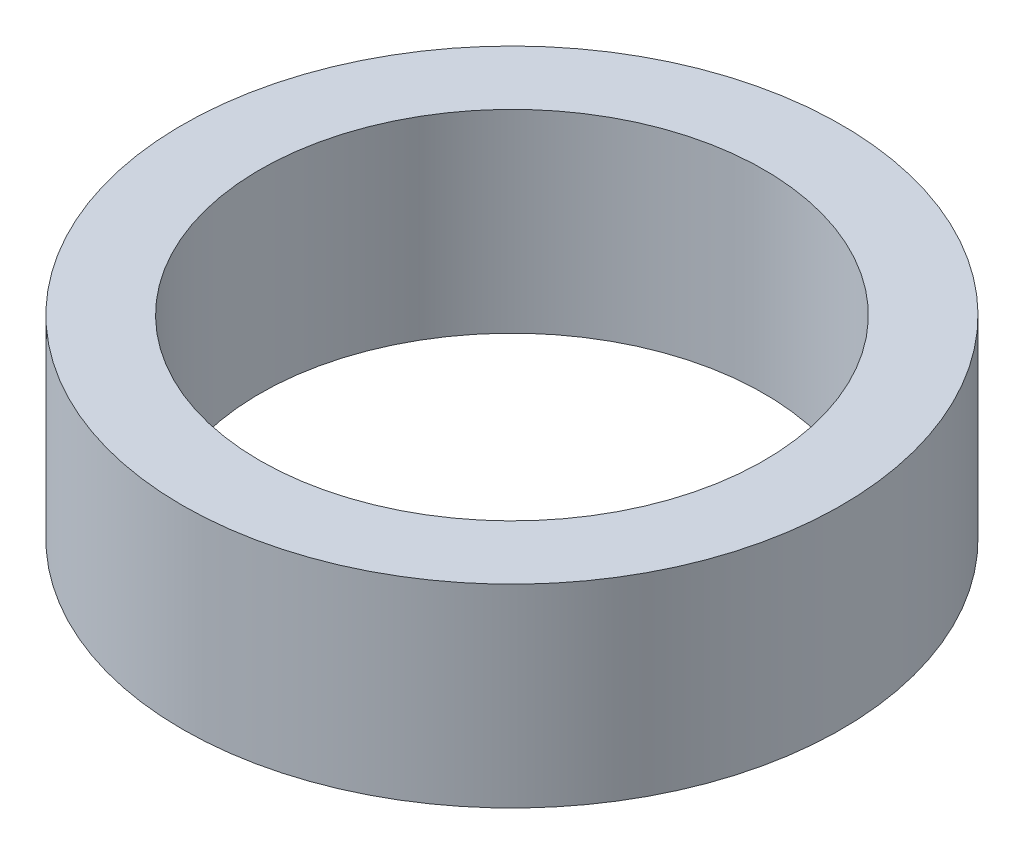
ISO-10303-21;
HEADER;
FILE_DESCRIPTION(('STEP AP214'),'2;1');
FILE_NAME('part.step','',(''),(''),'','','');
FILE_SCHEMA(('AUTOMOTIVE_DESIGN { 1 0 10303 214 1 1 1 1 }'));
ENDSEC;
DATA;
#1=APPLICATION_CONTEXT('core data for automotive mechanical design processes');
#2=APPLICATION_PROTOCOL_DEFINITION('international standard','automotive_design',2000,#1);
#3=PRODUCT_CONTEXT('',#1,'mechanical');
#4=PRODUCT('Part','Part','',(#3));
#5=PRODUCT_RELATED_PRODUCT_CATEGORY('part','',(#4));
#6=PRODUCT_DEFINITION_FORMATION('','',#4);
#7=PRODUCT_DEFINITION_CONTEXT('part definition',#1,'design');
#8=PRODUCT_DEFINITION('design','',#6,#7);
#9=PRODUCT_DEFINITION_SHAPE('','',#8);
#10=(LENGTH_UNIT() NAMED_UNIT(*) SI_UNIT(.MILLI.,.METRE.));
#11=(NAMED_UNIT(*) PLANE_ANGLE_UNIT() SI_UNIT($,.RADIAN.));
#12=(NAMED_UNIT(*) SI_UNIT($,.STERADIAN.) SOLID_ANGLE_UNIT());
#13=UNCERTAINTY_MEASURE_WITH_UNIT(LENGTH_MEASURE(1.E-05),#10,'distance_accuracy_value','');
#14=(GEOMETRIC_REPRESENTATION_CONTEXT(3) GLOBAL_UNCERTAINTY_ASSIGNED_CONTEXT((#13)) GLOBAL_UNIT_ASSIGNED_CONTEXT((#10,
#11,#12)) REPRESENTATION_CONTEXT('',''));
#15=CARTESIAN_POINT('',(0.,0.,0.));
#16=DIRECTION('',(0.,0.,1.));
#17=DIRECTION('',(1.,0.,0.));
#18=AXIS2_PLACEMENT_3D('',#15,#16,#17);
#19=CARTESIAN_POINT('',(0.,25.,0.));
#20=DIRECTION('',(0.,-1.,0.));
#21=DIRECTION('',(0.,0.,-1.));
#22=AXIS2_PLACEMENT_3D('',#19,#20,#21);
#23=CYLINDRICAL_SURFACE('',#22,42.5);
#24=CARTESIAN_POINT('',(0.,25.,0.));
#25=DIRECTION('',(0.,1.,0.));
#26=DIRECTION('',(0.,0.,1.));
#27=AXIS2_PLACEMENT_3D('',#24,#25,#26);
#28=CIRCLE('',#27,42.5);
#29=CARTESIAN_POINT('',(0.,25.,42.5));
#30=VERTEX_POINT('',#29);
#31=EDGE_CURVE('E10',#30,#30,#28,.T.);
#32=ORIENTED_EDGE('',*,*,#31,.F.);
#33=EDGE_LOOP('',(#32));
#34=FACE_BOUND('',#33,.T.);
#35=CARTESIAN_POINT('',(0.,0.,0.));
#36=DIRECTION('',(0.,1.,0.));
#37=DIRECTION('',(0.,0.,1.));
#38=AXIS2_PLACEMENT_3D('',#35,#36,#37);
#39=CIRCLE('',#38,42.5);
#40=CARTESIAN_POINT('',(0.,0.,42.5));
#41=VERTEX_POINT('',#40);
#42=EDGE_CURVE('E37',#41,#41,#39,.T.);
#43=ORIENTED_EDGE('',*,*,#42,.T.);
#44=EDGE_LOOP('',(#43));
#45=FACE_BOUND('',#44,.T.);
#46=ADVANCED_FACE('F40',(#34,#45),#23,.T.);
#47=CARTESIAN_POINT('',(0.,25.,0.));
#48=DIRECTION('',(0.,1.,0.));
#49=DIRECTION('',(0.,0.,1.));
#50=AXIS2_PLACEMENT_3D('',#47,#48,#49);
#51=PLANE('',#50);
#52=CARTESIAN_POINT('',(0.,25.,0.));
#53=DIRECTION('',(0.,1.,0.));
#54=DIRECTION('',(0.,0.,1.));
#55=AXIS2_PLACEMENT_3D('',#52,#53,#54);
#56=CIRCLE('',#55,32.5);
#57=CARTESIAN_POINT('',(0.,25.,32.5));
#58=VERTEX_POINT('',#57);
#59=EDGE_CURVE('E50',#58,#58,#56,.T.);
#60=ORIENTED_EDGE('',*,*,#59,.F.);
#61=EDGE_LOOP('',(#60));
#62=FACE_BOUND('',#61,.T.);
#63=ORIENTED_EDGE('',*,*,#31,.T.);
#64=EDGE_LOOP('',(#63));
#65=FACE_BOUND('',#64,.T.);
#66=ADVANCED_FACE('F59',(#62,#65),#51,.T.);
#67=CARTESIAN_POINT('',(0.,0.,0.));
#68=DIRECTION('',(0.,1.,0.));
#69=DIRECTION('',(0.,0.,1.));
#70=AXIS2_PLACEMENT_3D('',#67,#68,#69);
#71=PLANE('',#70);
#72=CARTESIAN_POINT('',(0.,0.,0.));
#73=DIRECTION('',(0.,1.,0.));
#74=DIRECTION('',(0.,0.,1.));
#75=AXIS2_PLACEMENT_3D('',#72,#73,#74);
#76=CIRCLE('',#75,32.5);
#77=CARTESIAN_POINT('',(0.,0.,32.5));
#78=VERTEX_POINT('',#77);
#79=EDGE_CURVE('E47',#78,#78,#76,.T.);
#80=ORIENTED_EDGE('',*,*,#79,.T.);
#81=EDGE_LOOP('',(#80));
#82=FACE_BOUND('',#81,.T.);
#83=ORIENTED_EDGE('',*,*,#42,.F.);
#84=EDGE_LOOP('',(#83));
#85=FACE_BOUND('',#84,.T.);
#86=ADVANCED_FACE('F58',(#82,#85),#71,.F.);
#87=CARTESIAN_POINT('',(0.,25.,0.));
#88=DIRECTION('',(0.,-1.,0.));
#89=DIRECTION('',(0.,0.,-1.));
#90=AXIS2_PLACEMENT_3D('',#87,#88,#89);
#91=CYLINDRICAL_SURFACE('',#90,32.5);
#92=ORIENTED_EDGE('',*,*,#59,.T.);
#93=EDGE_LOOP('',(#92));
#94=FACE_BOUND('',#93,.T.);
#95=ORIENTED_EDGE('',*,*,#79,.F.);
#96=EDGE_LOOP('',(#95));
#97=FACE_BOUND('',#96,.T.);
#98=ADVANCED_FACE('F54',(#94,#97),#91,.F.);
#99=CLOSED_SHELL('',(#46,#66,#86,#98));
#100=MANIFOLD_SOLID_BREP('B2',#99);
#101=ADVANCED_BREP_SHAPE_REPRESENTATION('',(#18,#100),#14);
#102=SHAPE_DEFINITION_REPRESENTATION(#9,#101);
ENDSEC;
END-ISO-10303-21;
